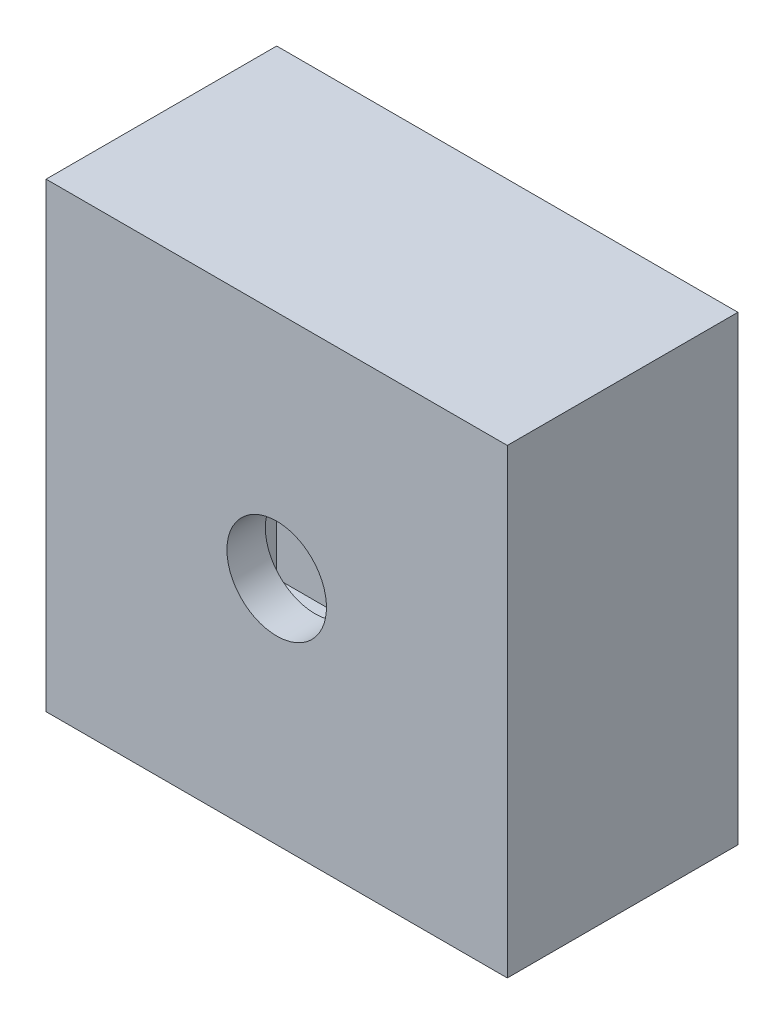
ISO-10303-21;
HEADER;
FILE_DESCRIPTION(('STEP AP214'),'2;1');
FILE_NAME('part.step','',(''),(''),'','','');
FILE_SCHEMA(('AUTOMOTIVE_DESIGN { 1 0 10303 214 1 1 1 1 }'));
ENDSEC;
DATA;
#1=APPLICATION_CONTEXT('core data for automotive mechanical design processes');
#2=APPLICATION_PROTOCOL_DEFINITION('international standard','automotive_design',2000,#1);
#3=PRODUCT_CONTEXT('',#1,'mechanical');
#4=PRODUCT('Part','Part','',(#3));
#5=PRODUCT_RELATED_PRODUCT_CATEGORY('part','',(#4));
#6=PRODUCT_DEFINITION_FORMATION('','',#4);
#7=PRODUCT_DEFINITION_CONTEXT('part definition',#1,'design');
#8=PRODUCT_DEFINITION('design','',#6,#7);
#9=PRODUCT_DEFINITION_SHAPE('','',#8);
#10=(LENGTH_UNIT() NAMED_UNIT(*) SI_UNIT(.MILLI.,.METRE.));
#11=(NAMED_UNIT(*) PLANE_ANGLE_UNIT() SI_UNIT($,.RADIAN.));
#12=(NAMED_UNIT(*) SI_UNIT($,.STERADIAN.) SOLID_ANGLE_UNIT());
#13=UNCERTAINTY_MEASURE_WITH_UNIT(LENGTH_MEASURE(1.E-05),#10,'distance_accuracy_value','');
#14=(GEOMETRIC_REPRESENTATION_CONTEXT(3) GLOBAL_UNCERTAINTY_ASSIGNED_CONTEXT((#13)) GLOBAL_UNIT_ASSIGNED_CONTEXT((#10,
#11,#12)) REPRESENTATION_CONTEXT('',''));
#15=CARTESIAN_POINT('',(0.,0.,0.));
#16=DIRECTION('',(0.,0.,1.));
#17=DIRECTION('',(1.,0.,0.));
#18=AXIS2_PLACEMENT_3D('',#15,#16,#17);
#19=CARTESIAN_POINT('',(0.,0.,100.));
#20=DIRECTION('',(0.,0.,1.));
#21=DIRECTION('',(1.,0.,0.));
#22=AXIS2_PLACEMENT_3D('',#19,#20,#21);
#23=PLANE('',#22);
#24=DIRECTION('',(1.,0.,0.));
#25=VECTOR('',#24,1.);
#26=CARTESIAN_POINT('',(-2.33885180928711E-13,-64.9999999999999,100.));
#27=LINE('',#26,#25);
#28=CARTESIAN_POINT('',(245.,-65.0000000000008,100.));
#29=VERTEX_POINT('',#28);
#30=CARTESIAN_POINT('',(375.,-65.0000000000013,100.));
#31=VERTEX_POINT('',#30);
#32=EDGE_CURVE('E297',#29,#31,#27,.T.);
#33=ORIENTED_EDGE('',*,*,#32,.F.);
#34=DIRECTION('',(0.,-1.,0.));
#35=VECTOR('',#34,1.);
#36=CARTESIAN_POINT('',(245.,-9.60030097644707E-13,100.));
#37=LINE('',#36,#35);
#38=CARTESIAN_POINT('',(245.,64.9999999999992,100.));
#39=VERTEX_POINT('',#38);
#40=EDGE_CURVE('E292',#39,#29,#37,.T.);
#41=ORIENTED_EDGE('',*,*,#40,.F.);
#42=DIRECTION('',(-1.,0.,0.));
#43=VECTOR('',#42,1.);
#44=CARTESIAN_POINT('',(2.26946287024804E-13,65.,100.));
#45=LINE('',#44,#43);
#46=CARTESIAN_POINT('',(375.,64.9999999999987,100.));
#47=VERTEX_POINT('',#46);
#48=EDGE_CURVE('E210',#47,#39,#45,.T.);
#49=ORIENTED_EDGE('',*,*,#48,.F.);
#50=DIRECTION('',(0.,1.,0.));
#51=VECTOR('',#50,1.);
#52=CARTESIAN_POINT('',(375.,-1.30930550206618E-12,100.));
#53=LINE('',#52,#51);
#54=EDGE_CURVE('E295',#31,#47,#53,.T.);
#55=ORIENTED_EDGE('',*,*,#54,.F.);
#56=EDGE_LOOP('',(#33,#41,#49,#55));
#57=FACE_BOUND('',#56,.T.);
#58=DIRECTION('',(0.,-1.,0.));
#59=VECTOR('',#58,1.);
#60=CARTESIAN_POINT('',(-64.9999999999999,0.,100.));
#61=LINE('',#60,#59);
#62=CARTESIAN_POINT('',(-65.,-245.,100.));
#63=VERTEX_POINT('',#62);
#64=CARTESIAN_POINT('',(-65.,-375.,100.));
#65=VERTEX_POINT('',#64);
#66=EDGE_CURVE('E290',#63,#65,#61,.T.);
#67=ORIENTED_EDGE('',*,*,#66,.F.);
#68=DIRECTION('',(-1.,0.,0.));
#69=VECTOR('',#68,1.);
#70=CARTESIAN_POINT('',(-1.0461716962814E-13,-245.,100.));
#71=LINE('',#70,#69);
#72=CARTESIAN_POINT('',(65.,-245.,100.));
#73=VERTEX_POINT('',#72);
#74=EDGE_CURVE('E284',#73,#63,#71,.T.);
#75=ORIENTED_EDGE('',*,*,#74,.F.);
#76=DIRECTION('',(0.,1.,0.));
#77=VECTOR('',#76,1.);
#78=CARTESIAN_POINT('',(65.,0.,100.));
#79=LINE('',#78,#77);
#80=CARTESIAN_POINT('',(65.,-375.,100.));
#81=VERTEX_POINT('',#80);
#82=EDGE_CURVE('E286',#81,#73,#79,.T.);
#83=ORIENTED_EDGE('',*,*,#82,.F.);
#84=DIRECTION('',(1.,0.,0.));
#85=VECTOR('',#84,1.);
#86=CARTESIAN_POINT('',(0.,-375.,100.));
#87=LINE('',#86,#85);
#88=EDGE_CURVE('E288',#65,#81,#87,.T.);
#89=ORIENTED_EDGE('',*,*,#88,.F.);
#90=EDGE_LOOP('',(#67,#75,#83,#89));
#91=FACE_BOUND('',#90,.T.);
#92=DIRECTION('',(-1.,0.,0.));
#93=VECTOR('',#92,1.);
#94=CARTESIAN_POINT('',(6.87777754978318E-13,64.9999999999999,100.));
#95=LINE('',#94,#93);
#96=CARTESIAN_POINT('',(-244.999999999999,65.0000000000025,100.));
#97=VERTEX_POINT('',#96);
#98=CARTESIAN_POINT('',(-374.999999999999,65.0000000000039,100.));
#99=VERTEX_POINT('',#98);
#100=EDGE_CURVE('E282',#97,#99,#95,.T.);
#101=ORIENTED_EDGE('',*,*,#100,.F.);
#102=DIRECTION('',(0.,1.,0.));
#103=VECTOR('',#102,1.);
#104=CARTESIAN_POINT('',(-245.,2.67085595367784E-12,100.));
#105=LINE('',#104,#103);
#106=CARTESIAN_POINT('',(-245.000000000001,-64.9999999999974,100.));
#107=VERTEX_POINT('',#106);
#108=EDGE_CURVE('E234',#107,#97,#105,.T.);
#109=ORIENTED_EDGE('',*,*,#108,.F.);
#110=DIRECTION('',(1.,0.,0.));
#111=VECTOR('',#110,1.);
#112=CARTESIAN_POINT('',(-6.80838861074411E-13,-65.,100.));
#113=LINE('',#112,#111);
#114=CARTESIAN_POINT('',(-375.000000000001,-64.9999999999961,100.));
#115=VERTEX_POINT('',#114);
#116=EDGE_CURVE('E277',#115,#107,#113,.T.);
#117=ORIENTED_EDGE('',*,*,#116,.F.);
#118=DIRECTION('',(0.,-1.,0.));
#119=VECTOR('',#118,1.);
#120=CARTESIAN_POINT('',(-375.,3.92791650619852E-12,100.));
#121=LINE('',#120,#119);
#122=EDGE_CURVE('E280',#99,#115,#121,.T.);
#123=ORIENTED_EDGE('',*,*,#122,.F.);
#124=EDGE_LOOP('',(#101,#109,#117,#123));
#125=FACE_BOUND('',#124,.T.);
#126=DIRECTION('',(0.,1.,0.));
#127=VECTOR('',#126,1.);
#128=CARTESIAN_POINT('',(64.9999999999999,0.,100.));
#129=LINE('',#128,#127);
#130=CARTESIAN_POINT('',(65.,245.,100.));
#131=VERTEX_POINT('',#130);
#132=CARTESIAN_POINT('',(65.,375.,100.));
#133=VERTEX_POINT('',#132);
#134=EDGE_CURVE('E326',#131,#133,#129,.T.);
#135=ORIENTED_EDGE('',*,*,#134,.F.);
#136=DIRECTION('',(1.,0.,0.));
#137=VECTOR('',#136,1.);
#138=CARTESIAN_POINT('',(1.0461716962814E-13,245.,100.));
#139=LINE('',#138,#137);
#140=CARTESIAN_POINT('',(-65.,245.,100.));
#141=VERTEX_POINT('',#140);
#142=EDGE_CURVE('E313',#141,#131,#139,.T.);
#143=ORIENTED_EDGE('',*,*,#142,.F.);
#144=DIRECTION('',(0.,-1.,0.));
#145=VECTOR('',#144,1.);
#146=CARTESIAN_POINT('',(-65.,0.,100.));
#147=LINE('',#146,#145);
#148=CARTESIAN_POINT('',(-65.,375.,100.));
#149=VERTEX_POINT('',#148);
#150=EDGE_CURVE('E321',#149,#141,#147,.T.);
#151=ORIENTED_EDGE('',*,*,#150,.F.);
#152=DIRECTION('',(-1.,0.,0.));
#153=VECTOR('',#152,1.);
#154=CARTESIAN_POINT('',(0.,375.,100.));
#155=LINE('',#154,#153);
#156=EDGE_CURVE('E324',#133,#149,#155,.T.);
#157=ORIENTED_EDGE('',*,*,#156,.F.);
#158=EDGE_LOOP('',(#135,#143,#151,#157));
#159=FACE_BOUND('',#158,.T.);
#160=CARTESIAN_POINT('',(0.,0.,100.));
#161=DIRECTION('',(0.,0.,1.));
#162=DIRECTION('',(1.,0.,0.));
#163=AXIS2_PLACEMENT_3D('',#160,#161,#162);
#164=CIRCLE('',#163,129.5);
#165=CARTESIAN_POINT('',(129.5,0.,100.));
#166=VERTEX_POINT('',#165);
#167=EDGE_CURVE('E334',#166,#166,#164,.T.);
#168=ORIENTED_EDGE('',*,*,#167,.F.);
#169=EDGE_LOOP('',(#168));
#170=FACE_BOUND('',#169,.T.);
#171=DIRECTION('',(0.,1.,0.));
#172=VECTOR('',#171,1.);
#173=CARTESIAN_POINT('',(500.,600.,100.));
#174=LINE('',#173,#172);
#175=CARTESIAN_POINT('',(500.,-500.,100.));
#176=VERTEX_POINT('',#175);
#177=CARTESIAN_POINT('',(500.,500.,100.));
#178=VERTEX_POINT('',#177);
#179=EDGE_CURVE('E346',#176,#178,#174,.T.);
#180=ORIENTED_EDGE('',*,*,#179,.T.);
#181=DIRECTION('',(-1.,0.,0.));
#182=VECTOR('',#181,1.);
#183=CARTESIAN_POINT('',(-600.,500.,100.));
#184=LINE('',#183,#182);
#185=CARTESIAN_POINT('',(-500.,500.,100.));
#186=VERTEX_POINT('',#185);
#187=EDGE_CURVE('E349',#178,#186,#184,.T.);
#188=ORIENTED_EDGE('',*,*,#187,.T.);
#189=DIRECTION('',(0.,-1.,0.));
#190=VECTOR('',#189,1.);
#191=CARTESIAN_POINT('',(-500.,600.,100.));
#192=LINE('',#191,#190);
#193=CARTESIAN_POINT('',(-500.,-500.,100.));
#194=VERTEX_POINT('',#193);
#195=EDGE_CURVE('E360',#186,#194,#192,.T.);
#196=ORIENTED_EDGE('',*,*,#195,.T.);
#197=DIRECTION('',(1.,0.,0.));
#198=VECTOR('',#197,1.);
#199=CARTESIAN_POINT('',(-600.,-500.,100.));
#200=LINE('',#199,#198);
#201=EDGE_CURVE('E357',#194,#176,#200,.T.);
#202=ORIENTED_EDGE('',*,*,#201,.T.);
#203=EDGE_LOOP('',(#180,#188,#196,#202));
#204=FACE_BOUND('',#203,.T.);
#205=ADVANCED_FACE('F43',(#57,#91,#125,#159,#170,#204),#23,.T.);
#206=CARTESIAN_POINT('',(-600.,-500.,600.));
#207=DIRECTION('',(0.,1.,0.));
#208=DIRECTION('',(0.,0.,1.));
#209=AXIS2_PLACEMENT_3D('',#206,#207,#208);
#210=PLANE('',#209);
#211=CARTESIAN_POINT('',(-344.367385343004,-500.,324.291039311099));
#212=DIRECTION('',(0.,1.,0.));
#213=DIRECTION('',(0.,0.,1.));
#214=AXIS2_PLACEMENT_3D('',#211,#212,#213);
#215=CIRCLE('',#214,120.);
#216=CARTESIAN_POINT('',(-344.367385343004,-500.,444.291039311099));
#217=VERTEX_POINT('',#216);
#218=EDGE_CURVE('E259',#217,#217,#215,.F.);
#219=ORIENTED_EDGE('',*,*,#218,.T.);
#220=EDGE_LOOP('',(#219));
#221=FACE_BOUND('',#220,.T.);
#222=DIRECTION('',(0.,0.,-1.));
#223=VECTOR('',#222,1.);
#224=CARTESIAN_POINT('',(-500.,-500.,600.));
#225=LINE('',#224,#223);
#226=CARTESIAN_POINT('',(-500.,-500.,500.));
#227=VERTEX_POINT('',#226);
#228=EDGE_CURVE('E356',#227,#194,#225,.T.);
#229=ORIENTED_EDGE('',*,*,#228,.F.);
#230=DIRECTION('',(1.,0.,0.));
#231=VECTOR('',#230,1.);
#232=CARTESIAN_POINT('',(-600.,-500.,500.));
#233=LINE('',#232,#231);
#234=CARTESIAN_POINT('',(500.,-500.,500.));
#235=VERTEX_POINT('',#234);
#236=EDGE_CURVE('E11',#227,#235,#233,.T.);
#237=ORIENTED_EDGE('',*,*,#236,.T.);
#238=DIRECTION('',(0.,0.,-1.));
#239=VECTOR('',#238,1.);
#240=CARTESIAN_POINT('',(500.,-500.,600.));
#241=LINE('',#240,#239);
#242=EDGE_CURVE('E354',#235,#176,#241,.T.);
#243=ORIENTED_EDGE('',*,*,#242,.T.);
#244=ORIENTED_EDGE('',*,*,#201,.F.);
#245=EDGE_LOOP('',(#229,#237,#243,#244));
#246=FACE_BOUND('',#245,.T.);
#247=ADVANCED_FACE('F427',(#221,#246),#210,.T.);
#248=CARTESIAN_POINT('',(-500.,600.,600.));
#249=DIRECTION('',(1.,0.,0.));
#250=DIRECTION('',(0.,1.,0.));
#251=AXIS2_PLACEMENT_3D('',#248,#249,#250);
#252=PLANE('',#251);
#253=DIRECTION('',(0.,0.,-1.));
#254=VECTOR('',#253,1.);
#255=CARTESIAN_POINT('',(-500.,500.,600.));
#256=LINE('',#255,#254);
#257=CARTESIAN_POINT('',(-500.,500.,500.));
#258=VERTEX_POINT('',#257);
#259=EDGE_CURVE('E353',#258,#186,#256,.T.);
#260=ORIENTED_EDGE('',*,*,#259,.F.);
#261=DIRECTION('',(0.,-1.,0.));
#262=VECTOR('',#261,1.);
#263=CARTESIAN_POINT('',(-500.,600.,500.));
#264=LINE('',#263,#262);
#265=EDGE_CURVE('E337',#258,#227,#264,.T.);
#266=ORIENTED_EDGE('',*,*,#265,.T.);
#267=ORIENTED_EDGE('',*,*,#228,.T.);
#268=ORIENTED_EDGE('',*,*,#195,.F.);
#269=EDGE_LOOP('',(#260,#266,#267,#268));
#270=FACE_BOUND('',#269,.T.);
#271=ADVANCED_FACE('F432',(#270),#252,.T.);
#272=CARTESIAN_POINT('',(-600.,500.,600.));
#273=DIRECTION('',(0.,-1.,0.));
#274=DIRECTION('',(0.,0.,-1.));
#275=AXIS2_PLACEMENT_3D('',#272,#273,#274);
#276=PLANE('',#275);
#277=DIRECTION('',(0.,0.,-1.));
#278=VECTOR('',#277,1.);
#279=CARTESIAN_POINT('',(500.,500.,600.));
#280=LINE('',#279,#278);
#281=CARTESIAN_POINT('',(500.,500.,500.));
#282=VERTEX_POINT('',#281);
#283=EDGE_CURVE('E350',#282,#178,#280,.T.);
#284=ORIENTED_EDGE('',*,*,#283,.F.);
#285=DIRECTION('',(-1.,0.,0.));
#286=VECTOR('',#285,1.);
#287=CARTESIAN_POINT('',(-600.,500.,500.));
#288=LINE('',#287,#286);
#289=EDGE_CURVE('E340',#282,#258,#288,.T.);
#290=ORIENTED_EDGE('',*,*,#289,.T.);
#291=ORIENTED_EDGE('',*,*,#259,.T.);
#292=ORIENTED_EDGE('',*,*,#187,.F.);
#293=EDGE_LOOP('',(#284,#290,#291,#292));
#294=FACE_BOUND('',#293,.T.);
#295=ADVANCED_FACE('F440',(#294),#276,.T.);
#296=CARTESIAN_POINT('',(500.,600.,600.));
#297=DIRECTION('',(-1.,0.,0.));
#298=DIRECTION('',(0.,-1.,0.));
#299=AXIS2_PLACEMENT_3D('',#296,#297,#298);
#300=PLANE('',#299);
#301=ORIENTED_EDGE('',*,*,#242,.F.);
#302=DIRECTION('',(0.,1.,0.));
#303=VECTOR('',#302,1.);
#304=CARTESIAN_POINT('',(500.,600.,500.));
#305=LINE('',#304,#303);
#306=EDGE_CURVE('E343',#235,#282,#305,.T.);
#307=ORIENTED_EDGE('',*,*,#306,.T.);
#308=ORIENTED_EDGE('',*,*,#283,.T.);
#309=ORIENTED_EDGE('',*,*,#179,.F.);
#310=EDGE_LOOP('',(#301,#307,#308,#309));
#311=FACE_BOUND('',#310,.T.);
#312=ADVANCED_FACE('F444',(#311),#300,.T.);
#313=CARTESIAN_POINT('',(0.,0.,500.));
#314=DIRECTION('',(0.,0.,1.));
#315=DIRECTION('',(1.,0.,0.));
#316=AXIS2_PLACEMENT_3D('',#313,#314,#315);
#317=PLANE('',#316);
#318=CARTESIAN_POINT('',(0.,0.,500.));
#319=DIRECTION('',(0.,0.,1.));
#320=DIRECTION('',(1.,0.,0.));
#321=AXIS2_PLACEMENT_3D('',#318,#319,#320);
#322=CIRCLE('',#321,129.5);
#323=CARTESIAN_POINT('',(129.5,0.,500.));
#324=VERTEX_POINT('',#323);
#325=EDGE_CURVE('E47',#324,#324,#322,.T.);
#326=ORIENTED_EDGE('',*,*,#325,.T.);
#327=EDGE_LOOP('',(#326));
#328=FACE_BOUND('',#327,.T.);
#329=ORIENTED_EDGE('',*,*,#306,.F.);
#330=ORIENTED_EDGE('',*,*,#236,.F.);
#331=ORIENTED_EDGE('',*,*,#265,.F.);
#332=ORIENTED_EDGE('',*,*,#289,.F.);
#333=EDGE_LOOP('',(#329,#330,#331,#332));
#334=FACE_BOUND('',#333,.T.);
#335=ADVANCED_FACE('F448',(#328,#334),#317,.F.);
#336=CARTESIAN_POINT('',(0.,0.,600.));
#337=DIRECTION('',(0.,0.,-1.));
#338=DIRECTION('',(-1.,0.,0.));
#339=AXIS2_PLACEMENT_3D('',#336,#337,#338);
#340=CYLINDRICAL_SURFACE('',#339,129.5);
#341=CARTESIAN_POINT('',(0.,0.,600.));
#342=DIRECTION('',(0.,0.,-1.));
#343=DIRECTION('',(-1.,0.,0.));
#344=AXIS2_PLACEMENT_3D('',#341,#342,#343);
#345=CIRCLE('',#344,129.5);
#346=CARTESIAN_POINT('',(-129.5,0.,600.));
#347=VERTEX_POINT('',#346);
#348=EDGE_CURVE('E329',#347,#347,#345,.T.);
#349=ORIENTED_EDGE('',*,*,#348,.F.);
#350=EDGE_LOOP('',(#349));
#351=FACE_BOUND('',#350,.T.);
#352=ORIENTED_EDGE('',*,*,#325,.F.);
#353=EDGE_LOOP('',(#352));
#354=FACE_BOUND('',#353,.T.);
#355=ADVANCED_FACE('F452',(#351,#354),#340,.F.);
#356=ORIENTED_EDGE('',*,*,#167,.T.);
#357=EDGE_LOOP('',(#356));
#358=FACE_BOUND('',#357,.T.);
#359=CARTESIAN_POINT('',(0.,0.,0.));
#360=DIRECTION('',(0.,0.,-1.));
#361=DIRECTION('',(-1.,0.,0.));
#362=AXIS2_PLACEMENT_3D('',#359,#360,#361);
#363=CIRCLE('',#362,129.5);
#364=CARTESIAN_POINT('',(-129.5,0.,0.));
#365=VERTEX_POINT('',#364);
#366=EDGE_CURVE('E328',#365,#365,#363,.T.);
#367=ORIENTED_EDGE('',*,*,#366,.T.);
#368=EDGE_LOOP('',(#367));
#369=FACE_BOUND('',#368,.T.);
#370=ADVANCED_FACE('F454',(#358,#369),#340,.F.);
#371=CARTESIAN_POINT('',(600.,600.,600.));
#372=DIRECTION('',(-1.,0.,0.));
#373=DIRECTION('',(0.,-1.,0.));
#374=AXIS2_PLACEMENT_3D('',#371,#372,#373);
#375=PLANE('',#374);
#376=DIRECTION('',(0.,0.,-1.));
#377=VECTOR('',#376,1.);
#378=CARTESIAN_POINT('',(600.,-600.,600.));
#379=LINE('',#378,#377);
#380=CARTESIAN_POINT('',(600.,-600.,600.));
#381=VERTEX_POINT('',#380);
#382=CARTESIAN_POINT('',(600.,-600.,0.));
#383=VERTEX_POINT('',#382);
#384=EDGE_CURVE('E377',#381,#383,#379,.T.);
#385=ORIENTED_EDGE('',*,*,#384,.T.);
#386=DIRECTION('',(0.,1.,0.));
#387=VECTOR('',#386,1.);
#388=CARTESIAN_POINT('',(600.,600.,0.));
#389=LINE('',#388,#387);
#390=CARTESIAN_POINT('',(600.,600.,0.));
#391=VERTEX_POINT('',#390);
#392=EDGE_CURVE('E352',#383,#391,#389,.T.);
#393=ORIENTED_EDGE('',*,*,#392,.T.);
#394=DIRECTION('',(0.,0.,-1.));
#395=VECTOR('',#394,1.);
#396=CARTESIAN_POINT('',(600.,600.,600.));
#397=LINE('',#396,#395);
#398=CARTESIAN_POINT('',(600.,600.,600.));
#399=VERTEX_POINT('',#398);
#400=EDGE_CURVE('E52',#399,#391,#397,.T.);
#401=ORIENTED_EDGE('',*,*,#400,.F.);
#402=DIRECTION('',(0.,1.,0.));
#403=VECTOR('',#402,1.);
#404=CARTESIAN_POINT('',(600.,600.,600.));
#405=LINE('',#404,#403);
#406=EDGE_CURVE('E367',#381,#399,#405,.T.);
#407=ORIENTED_EDGE('',*,*,#406,.F.);
#408=EDGE_LOOP('',(#385,#393,#401,#407));
#409=FACE_BOUND('',#408,.T.);
#410=ADVANCED_FACE('F45',(#409),#375,.F.);
#411=CARTESIAN_POINT('',(-600.,600.,600.));
#412=DIRECTION('',(0.,-1.,0.));
#413=DIRECTION('',(0.,0.,-1.));
#414=AXIS2_PLACEMENT_3D('',#411,#412,#413);
#415=PLANE('',#414);
#416=ORIENTED_EDGE('',*,*,#400,.T.);
#417=DIRECTION('',(-1.,0.,0.));
#418=VECTOR('',#417,1.);
#419=CARTESIAN_POINT('',(-600.,600.,0.));
#420=LINE('',#419,#418);
#421=CARTESIAN_POINT('',(-600.,600.,0.));
#422=VERTEX_POINT('',#421);
#423=EDGE_CURVE('E380',#391,#422,#420,.T.);
#424=ORIENTED_EDGE('',*,*,#423,.T.);
#425=DIRECTION('',(0.,0.,-1.));
#426=VECTOR('',#425,1.);
#427=CARTESIAN_POINT('',(-600.,600.,600.));
#428=LINE('',#427,#426);
#429=CARTESIAN_POINT('',(-600.,600.,600.));
#430=VERTEX_POINT('',#429);
#431=EDGE_CURVE('E391',#430,#422,#428,.T.);
#432=ORIENTED_EDGE('',*,*,#431,.F.);
#433=DIRECTION('',(-1.,0.,0.));
#434=VECTOR('',#433,1.);
#435=CARTESIAN_POINT('',(-600.,600.,600.));
#436=LINE('',#435,#434);
#437=EDGE_CURVE('E370',#399,#430,#436,.T.);
#438=ORIENTED_EDGE('',*,*,#437,.F.);
#439=EDGE_LOOP('',(#416,#424,#432,#438));
#440=FACE_BOUND('',#439,.T.);
#441=ADVANCED_FACE('F396',(#440),#415,.F.);
#442=CARTESIAN_POINT('',(-600.,600.,600.));
#443=DIRECTION('',(1.,0.,0.));
#444=DIRECTION('',(0.,1.,0.));
#445=AXIS2_PLACEMENT_3D('',#442,#443,#444);
#446=PLANE('',#445);
#447=ORIENTED_EDGE('',*,*,#431,.T.);
#448=DIRECTION('',(0.,-1.,0.));
#449=VECTOR('',#448,1.);
#450=CARTESIAN_POINT('',(-600.,600.,0.));
#451=LINE('',#450,#449);
#452=CARTESIAN_POINT('',(-600.,-600.,0.));
#453=VERTEX_POINT('',#452);
#454=EDGE_CURVE('E383',#422,#453,#451,.T.);
#455=ORIENTED_EDGE('',*,*,#454,.T.);
#456=DIRECTION('',(0.,0.,-1.));
#457=VECTOR('',#456,1.);
#458=CARTESIAN_POINT('',(-600.,-600.,600.));
#459=LINE('',#458,#457);
#460=CARTESIAN_POINT('',(-600.,-600.,600.));
#461=VERTEX_POINT('',#460);
#462=EDGE_CURVE('E389',#461,#453,#459,.T.);
#463=ORIENTED_EDGE('',*,*,#462,.F.);
#464=DIRECTION('',(0.,-1.,0.));
#465=VECTOR('',#464,1.);
#466=CARTESIAN_POINT('',(-600.,600.,600.));
#467=LINE('',#466,#465);
#468=EDGE_CURVE('E373',#430,#461,#467,.T.);
#469=ORIENTED_EDGE('',*,*,#468,.F.);
#470=EDGE_LOOP('',(#447,#455,#463,#469));
#471=FACE_BOUND('',#470,.T.);
#472=ADVANCED_FACE('F411',(#471),#446,.F.);
#473=CARTESIAN_POINT('',(-600.,-600.,600.));
#474=DIRECTION('',(0.,1.,0.));
#475=DIRECTION('',(0.,0.,1.));
#476=AXIS2_PLACEMENT_3D('',#473,#474,#475);
#477=PLANE('',#476);
#478=CARTESIAN_POINT('',(-344.367385343004,-600.,324.291039311099));
#479=DIRECTION('',(0.,-1.,0.));
#480=DIRECTION('',(0.,0.,-1.));
#481=AXIS2_PLACEMENT_3D('',#478,#479,#480);
#482=CIRCLE('',#481,120.);
#483=CARTESIAN_POINT('',(-344.367385343004,-600.,204.291039311099));
#484=VERTEX_POINT('',#483);
#485=EDGE_CURVE('E524',#484,#484,#482,.T.);
#486=ORIENTED_EDGE('',*,*,#485,.F.);
#487=EDGE_LOOP('',(#486));
#488=FACE_BOUND('',#487,.T.);
#489=ORIENTED_EDGE('',*,*,#462,.T.);
#490=DIRECTION('',(1.,0.,0.));
#491=VECTOR('',#490,1.);
#492=CARTESIAN_POINT('',(-600.,-600.,0.));
#493=LINE('',#492,#491);
#494=EDGE_CURVE('E371',#453,#383,#493,.T.);
#495=ORIENTED_EDGE('',*,*,#494,.T.);
#496=ORIENTED_EDGE('',*,*,#384,.F.);
#497=DIRECTION('',(1.,0.,0.));
#498=VECTOR('',#497,1.);
#499=CARTESIAN_POINT('',(-600.,-600.,600.));
#500=LINE('',#499,#498);
#501=EDGE_CURVE('E375',#461,#381,#500,.T.);
#502=ORIENTED_EDGE('',*,*,#501,.F.);
#503=EDGE_LOOP('',(#489,#495,#496,#502));
#504=FACE_BOUND('',#503,.T.);
#505=ADVANCED_FACE('F407',(#488,#504),#477,.F.);
#506=CARTESIAN_POINT('',(0.,0.,600.));
#507=DIRECTION('',(0.,0.,1.));
#508=DIRECTION('',(1.,0.,0.));
#509=AXIS2_PLACEMENT_3D('',#506,#507,#508);
#510=PLANE('',#509);
#511=ORIENTED_EDGE('',*,*,#348,.T.);
#512=EDGE_LOOP('',(#511));
#513=FACE_BOUND('',#512,.T.);
#514=ORIENTED_EDGE('',*,*,#406,.T.);
#515=ORIENTED_EDGE('',*,*,#437,.T.);
#516=ORIENTED_EDGE('',*,*,#468,.T.);
#517=ORIENTED_EDGE('',*,*,#501,.T.);
#518=EDGE_LOOP('',(#514,#515,#516,#517));
#519=FACE_BOUND('',#518,.T.);
#520=ADVANCED_FACE('F413',(#513,#519),#510,.T.);
#521=CARTESIAN_POINT('',(0.,0.,0.));
#522=DIRECTION('',(0.,0.,1.));
#523=DIRECTION('',(1.,0.,0.));
#524=AXIS2_PLACEMENT_3D('',#521,#522,#523);
#525=PLANE('',#524);
#526=DIRECTION('',(0.,1.,0.));
#527=VECTOR('',#526,1.);
#528=CARTESIAN_POINT('',(245.,64.9999999999992,0.));
#529=LINE('',#528,#527);
#530=CARTESIAN_POINT('',(245.,-65.0000000000008,0.));
#531=VERTEX_POINT('',#530);
#532=CARTESIAN_POINT('',(245.,64.9999999999992,0.));
#533=VERTEX_POINT('',#532);
#534=EDGE_CURVE('E217',#531,#533,#529,.T.);
#535=ORIENTED_EDGE('',*,*,#534,.F.);
#536=DIRECTION('',(-1.,0.,0.));
#537=VECTOR('',#536,1.);
#538=CARTESIAN_POINT('',(375.,-65.0000000000013,0.));
#539=LINE('',#538,#537);
#540=CARTESIAN_POINT('',(375.,-65.0000000000013,0.));
#541=VERTEX_POINT('',#540);
#542=EDGE_CURVE('E222',#541,#531,#539,.T.);
#543=ORIENTED_EDGE('',*,*,#542,.F.);
#544=DIRECTION('',(0.,-1.,0.));
#545=VECTOR('',#544,1.);
#546=CARTESIAN_POINT('',(375.,64.9999999999987,0.));
#547=LINE('',#546,#545);
#548=CARTESIAN_POINT('',(375.,64.9999999999987,0.));
#549=VERTEX_POINT('',#548);
#550=EDGE_CURVE('E227',#549,#541,#547,.T.);
#551=ORIENTED_EDGE('',*,*,#550,.F.);
#552=DIRECTION('',(1.,0.,0.));
#553=VECTOR('',#552,1.);
#554=CARTESIAN_POINT('',(375.,64.9999999999987,0.));
#555=LINE('',#554,#553);
#556=EDGE_CURVE('E207',#533,#549,#555,.T.);
#557=ORIENTED_EDGE('',*,*,#556,.F.);
#558=EDGE_LOOP('',(#535,#543,#551,#557));
#559=FACE_BOUND('',#558,.T.);
#560=DIRECTION('',(1.,0.,0.));
#561=VECTOR('',#560,1.);
#562=CARTESIAN_POINT('',(65.,-245.,0.));
#563=LINE('',#562,#561);
#564=CARTESIAN_POINT('',(-65.,-245.,0.));
#565=VERTEX_POINT('',#564);
#566=CARTESIAN_POINT('',(65.,-245.,0.));
#567=VERTEX_POINT('',#566);
#568=EDGE_CURVE('E239',#565,#567,#563,.T.);
#569=ORIENTED_EDGE('',*,*,#568,.F.);
#570=DIRECTION('',(0.,1.,0.));
#571=VECTOR('',#570,1.);
#572=CARTESIAN_POINT('',(-65.,-375.,0.));
#573=LINE('',#572,#571);
#574=CARTESIAN_POINT('',(-65.,-375.,0.));
#575=VERTEX_POINT('',#574);
#576=EDGE_CURVE('E237',#575,#565,#573,.T.);
#577=ORIENTED_EDGE('',*,*,#576,.F.);
#578=DIRECTION('',(-1.,0.,0.));
#579=VECTOR('',#578,1.);
#580=CARTESIAN_POINT('',(65.,-375.,0.));
#581=LINE('',#580,#579);
#582=CARTESIAN_POINT('',(65.,-375.,0.));
#583=VERTEX_POINT('',#582);
#584=EDGE_CURVE('E245',#583,#575,#581,.T.);
#585=ORIENTED_EDGE('',*,*,#584,.F.);
#586=DIRECTION('',(0.,-1.,0.));
#587=VECTOR('',#586,1.);
#588=CARTESIAN_POINT('',(65.,-375.,0.));
#589=LINE('',#588,#587);
#590=EDGE_CURVE('E242',#567,#583,#589,.T.);
#591=ORIENTED_EDGE('',*,*,#590,.F.);
#592=EDGE_LOOP('',(#569,#577,#585,#591));
#593=FACE_BOUND('',#592,.T.);
#594=DIRECTION('',(0.,-1.,0.));
#595=VECTOR('',#594,1.);
#596=CARTESIAN_POINT('',(-245.000000000001,-64.9999999999974,0.));
#597=LINE('',#596,#595);
#598=CARTESIAN_POINT('',(-244.999999999999,65.0000000000025,0.));
#599=VERTEX_POINT('',#598);
#600=CARTESIAN_POINT('',(-245.000000000001,-64.9999999999974,0.));
#601=VERTEX_POINT('',#600);
#602=EDGE_CURVE('E258',#599,#601,#597,.T.);
#603=ORIENTED_EDGE('',*,*,#602,.F.);
#604=DIRECTION('',(1.,0.,0.));
#605=VECTOR('',#604,1.);
#606=CARTESIAN_POINT('',(-374.999999999999,65.0000000000039,0.));
#607=LINE('',#606,#605);
#608=CARTESIAN_POINT('',(-374.999999999999,65.0000000000039,0.));
#609=VERTEX_POINT('',#608);
#610=EDGE_CURVE('E256',#609,#599,#607,.T.);
#611=ORIENTED_EDGE('',*,*,#610,.F.);
#612=DIRECTION('',(0.,1.,0.));
#613=VECTOR('',#612,1.);
#614=CARTESIAN_POINT('',(-375.000000000001,-64.9999999999961,0.));
#615=LINE('',#614,#613);
#616=CARTESIAN_POINT('',(-375.000000000001,-64.9999999999961,0.));
#617=VERTEX_POINT('',#616);
#618=EDGE_CURVE('E265',#617,#609,#615,.T.);
#619=ORIENTED_EDGE('',*,*,#618,.F.);
#620=DIRECTION('',(-1.,0.,0.));
#621=VECTOR('',#620,1.);
#622=CARTESIAN_POINT('',(-375.000000000001,-64.9999999999961,0.));
#623=LINE('',#622,#621);
#624=EDGE_CURVE('E262',#601,#617,#623,.T.);
#625=ORIENTED_EDGE('',*,*,#624,.F.);
#626=EDGE_LOOP('',(#603,#611,#619,#625));
#627=FACE_BOUND('',#626,.T.);
#628=DIRECTION('',(-1.,0.,0.));
#629=VECTOR('',#628,1.);
#630=CARTESIAN_POINT('',(-65.,245.,0.));
#631=LINE('',#630,#629);
#632=CARTESIAN_POINT('',(65.,245.,0.));
#633=VERTEX_POINT('',#632);
#634=CARTESIAN_POINT('',(-65.,245.,0.));
#635=VERTEX_POINT('',#634);
#636=EDGE_CURVE('E301',#633,#635,#631,.T.);
#637=ORIENTED_EDGE('',*,*,#636,.F.);
#638=DIRECTION('',(0.,-1.,0.));
#639=VECTOR('',#638,1.);
#640=CARTESIAN_POINT('',(65.,375.,0.));
#641=LINE('',#640,#639);
#642=CARTESIAN_POINT('',(65.,375.,0.));
#643=VERTEX_POINT('',#642);
#644=EDGE_CURVE('E299',#643,#633,#641,.T.);
#645=ORIENTED_EDGE('',*,*,#644,.F.);
#646=DIRECTION('',(1.,0.,0.));
#647=VECTOR('',#646,1.);
#648=CARTESIAN_POINT('',(-65.,375.,0.));
#649=LINE('',#648,#647);
#650=CARTESIAN_POINT('',(-65.,375.,0.));
#651=VERTEX_POINT('',#650);
#652=EDGE_CURVE('E307',#651,#643,#649,.T.);
#653=ORIENTED_EDGE('',*,*,#652,.F.);
#654=DIRECTION('',(0.,1.,0.));
#655=VECTOR('',#654,1.);
#656=CARTESIAN_POINT('',(-65.,375.,0.));
#657=LINE('',#656,#655);
#658=EDGE_CURVE('E304',#635,#651,#657,.T.);
#659=ORIENTED_EDGE('',*,*,#658,.F.);
#660=EDGE_LOOP('',(#637,#645,#653,#659));
#661=FACE_BOUND('',#660,.T.);
#662=ORIENTED_EDGE('',*,*,#366,.F.);
#663=EDGE_LOOP('',(#662));
#664=FACE_BOUND('',#663,.T.);
#665=ORIENTED_EDGE('',*,*,#392,.F.);
#666=ORIENTED_EDGE('',*,*,#494,.F.);
#667=ORIENTED_EDGE('',*,*,#454,.F.);
#668=ORIENTED_EDGE('',*,*,#423,.F.);
#669=EDGE_LOOP('',(#665,#666,#667,#668));
#670=FACE_BOUND('',#669,.T.);
#671=ADVANCED_FACE('F224',(#559,#593,#627,#661,#664,#670),#525,.F.);
#672=CARTESIAN_POINT('',(65.,375.,146.));
#673=DIRECTION('',(1.,0.,0.));
#674=DIRECTION('',(0.,1.,0.));
#675=AXIS2_PLACEMENT_3D('',#672,#673,#674);
#676=PLANE('',#675);
#677=ORIENTED_EDGE('',*,*,#134,.T.);
#678=DIRECTION('',(0.,0.,-1.));
#679=VECTOR('',#678,1.);
#680=CARTESIAN_POINT('',(65.,375.,146.));
#681=LINE('',#680,#679);
#682=EDGE_CURVE('E311',#133,#643,#681,.T.);
#683=ORIENTED_EDGE('',*,*,#682,.T.);
#684=ORIENTED_EDGE('',*,*,#644,.T.);
#685=DIRECTION('',(0.,0.,-1.));
#686=VECTOR('',#685,1.);
#687=CARTESIAN_POINT('',(65.,245.,146.));
#688=LINE('',#687,#686);
#689=EDGE_CURVE('E310',#131,#633,#688,.T.);
#690=ORIENTED_EDGE('',*,*,#689,.F.);
#691=EDGE_LOOP('',(#677,#683,#684,#690));
#692=FACE_BOUND('',#691,.T.);
#693=ADVANCED_FACE('F421',(#692),#676,.F.);
#694=CARTESIAN_POINT('',(-65.,375.,146.));
#695=DIRECTION('',(0.,1.,0.));
#696=DIRECTION('',(0.,0.,1.));
#697=AXIS2_PLACEMENT_3D('',#694,#695,#696);
#698=PLANE('',#697);
#699=ORIENTED_EDGE('',*,*,#156,.T.);
#700=DIRECTION('',(0.,0.,-1.));
#701=VECTOR('',#700,1.);
#702=CARTESIAN_POINT('',(-65.,375.,146.));
#703=LINE('',#702,#701);
#704=EDGE_CURVE('E314',#149,#651,#703,.T.);
#705=ORIENTED_EDGE('',*,*,#704,.T.);
#706=ORIENTED_EDGE('',*,*,#652,.T.);
#707=ORIENTED_EDGE('',*,*,#682,.F.);
#708=EDGE_LOOP('',(#699,#705,#706,#707));
#709=FACE_BOUND('',#708,.T.);
#710=ADVANCED_FACE('F460',(#709),#698,.F.);
#711=CARTESIAN_POINT('',(-65.,375.,146.));
#712=DIRECTION('',(-1.,0.,0.));
#713=DIRECTION('',(0.,0.,1.));
#714=AXIS2_PLACEMENT_3D('',#711,#712,#713);
#715=PLANE('',#714);
#716=ORIENTED_EDGE('',*,*,#150,.T.);
#717=DIRECTION('',(0.,0.,-1.));
#718=VECTOR('',#717,1.);
#719=CARTESIAN_POINT('',(-65.,245.,146.));
#720=LINE('',#719,#718);
#721=EDGE_CURVE('E316',#141,#635,#720,.T.);
#722=ORIENTED_EDGE('',*,*,#721,.T.);
#723=ORIENTED_EDGE('',*,*,#658,.T.);
#724=ORIENTED_EDGE('',*,*,#704,.F.);
#725=EDGE_LOOP('',(#716,#722,#723,#724));
#726=FACE_BOUND('',#725,.T.);
#727=ADVANCED_FACE('F466',(#726),#715,.F.);
#728=CARTESIAN_POINT('',(-65.,245.,146.));
#729=DIRECTION('',(0.,-1.,0.));
#730=DIRECTION('',(1.,0.,0.));
#731=AXIS2_PLACEMENT_3D('',#728,#729,#730);
#732=PLANE('',#731);
#733=ORIENTED_EDGE('',*,*,#142,.T.);
#734=ORIENTED_EDGE('',*,*,#689,.T.);
#735=ORIENTED_EDGE('',*,*,#636,.T.);
#736=ORIENTED_EDGE('',*,*,#721,.F.);
#737=EDGE_LOOP('',(#733,#734,#735,#736));
#738=FACE_BOUND('',#737,.T.);
#739=ADVANCED_FACE('F462',(#738),#732,.F.);
#740=CARTESIAN_POINT('',(-374.999999999999,65.0000000000039,146.));
#741=DIRECTION('',(0.,1.,0.));
#742=DIRECTION('',(-1.,0.,0.));
#743=AXIS2_PLACEMENT_3D('',#740,#741,#742);
#744=PLANE('',#743);
#745=ORIENTED_EDGE('',*,*,#100,.T.);
#746=DIRECTION('',(0.,0.,-1.));
#747=VECTOR('',#746,1.);
#748=CARTESIAN_POINT('',(-374.999999999999,65.0000000000039,146.));
#749=LINE('',#748,#747);
#750=EDGE_CURVE('E240',#99,#609,#749,.T.);
#751=ORIENTED_EDGE('',*,*,#750,.T.);
#752=ORIENTED_EDGE('',*,*,#610,.T.);
#753=DIRECTION('',(0.,0.,-1.));
#754=VECTOR('',#753,1.);
#755=CARTESIAN_POINT('',(-244.999999999999,65.0000000000025,146.));
#756=LINE('',#755,#754);
#757=EDGE_CURVE('E268',#97,#599,#756,.T.);
#758=ORIENTED_EDGE('',*,*,#757,.F.);
#759=EDGE_LOOP('',(#745,#751,#752,#758));
#760=FACE_BOUND('',#759,.T.);
#761=ADVANCED_FACE('F465',(#760),#744,.F.);
#762=CARTESIAN_POINT('',(-375.000000000001,-64.9999999999961,146.));
#763=DIRECTION('',(-1.,0.,0.));
#764=DIRECTION('',(0.,-1.,0.));
#765=AXIS2_PLACEMENT_3D('',#762,#763,#764);
#766=PLANE('',#765);
#767=ORIENTED_EDGE('',*,*,#122,.T.);
#768=DIRECTION('',(0.,0.,-1.));
#769=VECTOR('',#768,1.);
#770=CARTESIAN_POINT('',(-375.000000000001,-64.9999999999961,146.));
#771=LINE('',#770,#769);
#772=EDGE_CURVE('E270',#115,#617,#771,.T.);
#773=ORIENTED_EDGE('',*,*,#772,.T.);
#774=ORIENTED_EDGE('',*,*,#618,.T.);
#775=ORIENTED_EDGE('',*,*,#750,.F.);
#776=EDGE_LOOP('',(#767,#773,#774,#775));
#777=FACE_BOUND('',#776,.T.);
#778=ADVANCED_FACE('F476',(#777),#766,.F.);
#779=CARTESIAN_POINT('',(-375.000000000001,-64.9999999999961,146.));
#780=DIRECTION('',(0.,-1.,0.));
#781=DIRECTION('',(1.,0.,0.));
#782=AXIS2_PLACEMENT_3D('',#779,#780,#781);
#783=PLANE('',#782);
#784=ORIENTED_EDGE('',*,*,#116,.T.);
#785=DIRECTION('',(0.,0.,-1.));
#786=VECTOR('',#785,1.);
#787=CARTESIAN_POINT('',(-245.000000000001,-64.9999999999974,146.));
#788=LINE('',#787,#786);
#789=EDGE_CURVE('E272',#107,#601,#788,.T.);
#790=ORIENTED_EDGE('',*,*,#789,.T.);
#791=ORIENTED_EDGE('',*,*,#624,.T.);
#792=ORIENTED_EDGE('',*,*,#772,.F.);
#793=EDGE_LOOP('',(#784,#790,#791,#792));
#794=FACE_BOUND('',#793,.T.);
#795=ADVANCED_FACE('F482',(#794),#783,.F.);
#796=CARTESIAN_POINT('',(-245.000000000001,-64.9999999999974,146.));
#797=DIRECTION('',(1.,0.,0.));
#798=DIRECTION('',(0.,1.,0.));
#799=AXIS2_PLACEMENT_3D('',#796,#797,#798);
#800=PLANE('',#799);
#801=ORIENTED_EDGE('',*,*,#108,.T.);
#802=ORIENTED_EDGE('',*,*,#757,.T.);
#803=ORIENTED_EDGE('',*,*,#602,.T.);
#804=ORIENTED_EDGE('',*,*,#789,.F.);
#805=EDGE_LOOP('',(#801,#802,#803,#804));
#806=FACE_BOUND('',#805,.T.);
#807=ADVANCED_FACE('F478',(#806),#800,.F.);
#808=CARTESIAN_POINT('',(-65.,-375.,146.));
#809=DIRECTION('',(-1.,0.,0.));
#810=DIRECTION('',(0.,-1.,0.));
#811=AXIS2_PLACEMENT_3D('',#808,#809,#810);
#812=PLANE('',#811);
#813=ORIENTED_EDGE('',*,*,#66,.T.);
#814=DIRECTION('',(0.,0.,-1.));
#815=VECTOR('',#814,1.);
#816=CARTESIAN_POINT('',(-65.,-375.,146.));
#817=LINE('',#816,#815);
#818=EDGE_CURVE('E249',#65,#575,#817,.T.);
#819=ORIENTED_EDGE('',*,*,#818,.T.);
#820=ORIENTED_EDGE('',*,*,#576,.T.);
#821=DIRECTION('',(0.,0.,-1.));
#822=VECTOR('',#821,1.);
#823=CARTESIAN_POINT('',(-65.,-245.,146.));
#824=LINE('',#823,#822);
#825=EDGE_CURVE('E248',#63,#565,#824,.T.);
#826=ORIENTED_EDGE('',*,*,#825,.F.);
#827=EDGE_LOOP('',(#813,#819,#820,#826));
#828=FACE_BOUND('',#827,.T.);
#829=ADVANCED_FACE('F481',(#828),#812,.F.);
#830=CARTESIAN_POINT('',(65.,-375.,146.));
#831=DIRECTION('',(0.,-1.,0.));
#832=DIRECTION('',(0.,0.,-1.));
#833=AXIS2_PLACEMENT_3D('',#830,#831,#832);
#834=PLANE('',#833);
#835=ORIENTED_EDGE('',*,*,#88,.T.);
#836=DIRECTION('',(0.,0.,-1.));
#837=VECTOR('',#836,1.);
#838=CARTESIAN_POINT('',(65.,-375.,146.));
#839=LINE('',#838,#837);
#840=EDGE_CURVE('E251',#81,#583,#839,.T.);
#841=ORIENTED_EDGE('',*,*,#840,.T.);
#842=ORIENTED_EDGE('',*,*,#584,.T.);
#843=ORIENTED_EDGE('',*,*,#818,.F.);
#844=EDGE_LOOP('',(#835,#841,#842,#843));
#845=FACE_BOUND('',#844,.T.);
#846=ADVANCED_FACE('F492',(#845),#834,.F.);
#847=CARTESIAN_POINT('',(65.,-375.,146.));
#848=DIRECTION('',(1.,0.,0.));
#849=DIRECTION('',(0.,0.,-1.));
#850=AXIS2_PLACEMENT_3D('',#847,#848,#849);
#851=PLANE('',#850);
#852=ORIENTED_EDGE('',*,*,#82,.T.);
#853=DIRECTION('',(0.,0.,-1.));
#854=VECTOR('',#853,1.);
#855=CARTESIAN_POINT('',(65.,-245.,146.));
#856=LINE('',#855,#854);
#857=EDGE_CURVE('E67',#73,#567,#856,.T.);
#858=ORIENTED_EDGE('',*,*,#857,.T.);
#859=ORIENTED_EDGE('',*,*,#590,.T.);
#860=ORIENTED_EDGE('',*,*,#840,.F.);
#861=EDGE_LOOP('',(#852,#858,#859,#860));
#862=FACE_BOUND('',#861,.T.);
#863=ADVANCED_FACE('F498',(#862),#851,.F.);
#864=CARTESIAN_POINT('',(65.,-245.,146.));
#865=DIRECTION('',(0.,1.,0.));
#866=DIRECTION('',(-1.,0.,0.));
#867=AXIS2_PLACEMENT_3D('',#864,#865,#866);
#868=PLANE('',#867);
#869=ORIENTED_EDGE('',*,*,#74,.T.);
#870=ORIENTED_EDGE('',*,*,#825,.T.);
#871=ORIENTED_EDGE('',*,*,#568,.T.);
#872=ORIENTED_EDGE('',*,*,#857,.F.);
#873=EDGE_LOOP('',(#869,#870,#871,#872));
#874=FACE_BOUND('',#873,.T.);
#875=ADVANCED_FACE('F494',(#874),#868,.F.);
#876=CARTESIAN_POINT('',(375.,-65.0000000000013,146.));
#877=DIRECTION('',(0.,-1.,0.));
#878=DIRECTION('',(1.,0.,0.));
#879=AXIS2_PLACEMENT_3D('',#876,#877,#878);
#880=PLANE('',#879);
#881=ORIENTED_EDGE('',*,*,#32,.T.);
#882=DIRECTION('',(0.,0.,-1.));
#883=VECTOR('',#882,1.);
#884=CARTESIAN_POINT('',(375.,-65.0000000000013,146.));
#885=LINE('',#884,#883);
#886=EDGE_CURVE('E232',#31,#541,#885,.T.);
#887=ORIENTED_EDGE('',*,*,#886,.T.);
#888=ORIENTED_EDGE('',*,*,#542,.T.);
#889=DIRECTION('',(0.,0.,-1.));
#890=VECTOR('',#889,1.);
#891=CARTESIAN_POINT('',(245.,-65.0000000000008,146.));
#892=LINE('',#891,#890);
#893=EDGE_CURVE('E213',#29,#531,#892,.T.);
#894=ORIENTED_EDGE('',*,*,#893,.F.);
#895=EDGE_LOOP('',(#881,#887,#888,#894));
#896=FACE_BOUND('',#895,.T.);
#897=ADVANCED_FACE('F497',(#896),#880,.F.);
#898=CARTESIAN_POINT('',(375.,64.9999999999987,146.));
#899=DIRECTION('',(1.,0.,0.));
#900=DIRECTION('',(0.,1.,0.));
#901=AXIS2_PLACEMENT_3D('',#898,#899,#900);
#902=PLANE('',#901);
#903=ORIENTED_EDGE('',*,*,#54,.T.);
#904=DIRECTION('',(0.,0.,-1.));
#905=VECTOR('',#904,1.);
#906=CARTESIAN_POINT('',(375.,64.9999999999987,146.));
#907=LINE('',#906,#905);
#908=EDGE_CURVE('E212',#47,#549,#907,.T.);
#909=ORIENTED_EDGE('',*,*,#908,.T.);
#910=ORIENTED_EDGE('',*,*,#550,.T.);
#911=ORIENTED_EDGE('',*,*,#886,.F.);
#912=EDGE_LOOP('',(#903,#909,#910,#911));
#913=FACE_BOUND('',#912,.T.);
#914=ADVANCED_FACE('F507',(#913),#902,.F.);
#915=CARTESIAN_POINT('',(375.,64.9999999999987,146.));
#916=DIRECTION('',(0.,1.,0.));
#917=DIRECTION('',(-1.,0.,0.));
#918=AXIS2_PLACEMENT_3D('',#915,#916,#917);
#919=PLANE('',#918);
#920=ORIENTED_EDGE('',*,*,#48,.T.);
#921=DIRECTION('',(0.,0.,-1.));
#922=VECTOR('',#921,1.);
#923=CARTESIAN_POINT('',(245.,64.9999999999992,146.));
#924=LINE('',#923,#922);
#925=EDGE_CURVE('E59',#39,#533,#924,.T.);
#926=ORIENTED_EDGE('',*,*,#925,.T.);
#927=ORIENTED_EDGE('',*,*,#556,.T.);
#928=ORIENTED_EDGE('',*,*,#908,.F.);
#929=EDGE_LOOP('',(#920,#926,#927,#928));
#930=FACE_BOUND('',#929,.T.);
#931=ADVANCED_FACE('F204',(#930),#919,.F.);
#932=CARTESIAN_POINT('',(245.,64.9999999999992,146.));
#933=DIRECTION('',(-1.,0.,0.));
#934=DIRECTION('',(0.,-1.,0.));
#935=AXIS2_PLACEMENT_3D('',#932,#933,#934);
#936=PLANE('',#935);
#937=ORIENTED_EDGE('',*,*,#40,.T.);
#938=ORIENTED_EDGE('',*,*,#893,.T.);
#939=ORIENTED_EDGE('',*,*,#534,.T.);
#940=ORIENTED_EDGE('',*,*,#925,.F.);
#941=EDGE_LOOP('',(#937,#938,#939,#940));
#942=FACE_BOUND('',#941,.T.);
#943=ADVANCED_FACE('F218',(#942),#936,.F.);
#944=CARTESIAN_POINT('',(-344.367385343004,-160.588745030457,324.291039311099));
#945=DIRECTION('',(0.,-1.,0.));
#946=DIRECTION('',(0.,0.,-1.));
#947=AXIS2_PLACEMENT_3D('',#944,#945,#946);
#948=CYLINDRICAL_SURFACE('',#947,120.);
#949=ORIENTED_EDGE('',*,*,#485,.T.);
#950=EDGE_LOOP('',(#949));
#951=FACE_BOUND('',#950,.T.);
#952=ORIENTED_EDGE('',*,*,#218,.F.);
#953=EDGE_LOOP('',(#952));
#954=FACE_BOUND('',#953,.T.);
#955=ADVANCED_FACE('F511',(#951,#954),#948,.F.);
#956=CLOSED_SHELL('',(#205,#247,#271,#295,#312,#335,#355,#370,#410,#441,#472,#505,#520,#671,
#693,#710,#727,#739,#761,#778,#795,#807,#829,#846,#863,#875,#897,#914,#931,#943,#955));
#957=MANIFOLD_SOLID_BREP('B2',#956);
#958=ADVANCED_BREP_SHAPE_REPRESENTATION('',(#18,#957),#14);
#959=SHAPE_DEFINITION_REPRESENTATION(#9,#958);
ENDSEC;
END-ISO-10303-21;
